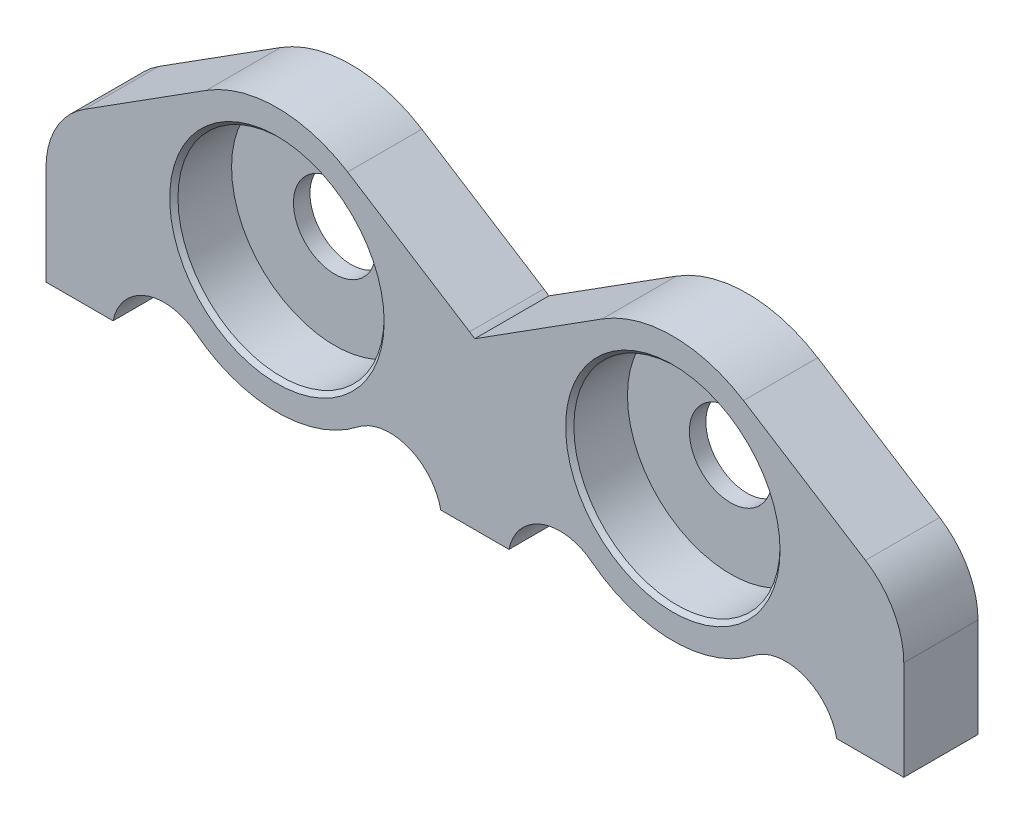
ISO-10303-21;
HEADER;
FILE_DESCRIPTION(('STEP AP214'),'2;1');
FILE_NAME('part.step','',(''),(''),'','','');
FILE_SCHEMA(('AUTOMOTIVE_DESIGN { 1 0 10303 214 1 1 1 1 }'));
ENDSEC;
DATA;
#1=APPLICATION_CONTEXT('core data for automotive mechanical design processes');
#2=APPLICATION_PROTOCOL_DEFINITION('international standard','automotive_design',2000,#1);
#3=PRODUCT_CONTEXT('',#1,'mechanical');
#4=PRODUCT('Part','Part','',(#3));
#5=PRODUCT_RELATED_PRODUCT_CATEGORY('part','',(#4));
#6=PRODUCT_DEFINITION_FORMATION('','',#4);
#7=PRODUCT_DEFINITION_CONTEXT('part definition',#1,'design');
#8=PRODUCT_DEFINITION('design','',#6,#7);
#9=PRODUCT_DEFINITION_SHAPE('','',#8);
#10=(LENGTH_UNIT() NAMED_UNIT(*) SI_UNIT(.MILLI.,.METRE.));
#11=(NAMED_UNIT(*) PLANE_ANGLE_UNIT() SI_UNIT($,.RADIAN.));
#12=(NAMED_UNIT(*) SI_UNIT($,.STERADIAN.) SOLID_ANGLE_UNIT());
#13=UNCERTAINTY_MEASURE_WITH_UNIT(LENGTH_MEASURE(1.E-05),#10,'distance_accuracy_value','');
#14=(GEOMETRIC_REPRESENTATION_CONTEXT(3) GLOBAL_UNCERTAINTY_ASSIGNED_CONTEXT((#13)) GLOBAL_UNIT_ASSIGNED_CONTEXT((#10,
#11,#12)) REPRESENTATION_CONTEXT('',''));
#15=CARTESIAN_POINT('',(0.,0.,0.));
#16=DIRECTION('',(0.,0.,1.));
#17=DIRECTION('',(1.,0.,0.));
#18=AXIS2_PLACEMENT_3D('',#15,#16,#17);
#19=CARTESIAN_POINT('',(8.34596377007962,54.3419699291666,62.151213910356));
#20=DIRECTION('',(0.,0.,1.));
#21=DIRECTION('',(1.,0.,0.));
#22=AXIS2_PLACEMENT_3D('',#19,#20,#21);
#23=CONICAL_SURFACE('',#22,6.,0.785398163397448);
#24=CARTESIAN_POINT('',(8.34596377007962,54.3419699291666,62.651213910356));
#25=DIRECTION('',(0.,0.,-1.));
#26=DIRECTION('',(1.,0.,0.));
#27=AXIS2_PLACEMENT_3D('',#24,#25,#26);
#28=CIRCLE('',#27,6.5);
#29=CARTESIAN_POINT('',(14.8459637700796,54.3419699291666,62.651213910356));
#30=VERTEX_POINT('',#29);
#31=EDGE_CURVE('E319',#30,#30,#28,.T.);
#32=ORIENTED_EDGE('',*,*,#31,.F.);
#33=EDGE_LOOP('',(#32));
#34=FACE_BOUND('',#33,.T.);
#35=CARTESIAN_POINT('',(8.34596377007962,54.3419699291666,62.401213910356));
#36=DIRECTION('',(0.,0.,1.));
#37=DIRECTION('',(1.,0.,0.));
#38=AXIS2_PLACEMENT_3D('',#35,#36,#37);
#39=CIRCLE('',#38,6.25);
#40=CARTESIAN_POINT('',(14.5959637700796,54.3419699291666,62.401213910356));
#41=VERTEX_POINT('',#40);
#42=EDGE_CURVE('E278',#41,#41,#39,.T.);
#43=ORIENTED_EDGE('',*,*,#42,.F.);
#44=EDGE_LOOP('',(#43));
#45=FACE_BOUND('',#44,.T.);
#46=ADVANCED_FACE('F44',(#34,#45),#23,.F.);
#47=CARTESIAN_POINT('',(32.3459637700796,54.3419699291666,62.151213910356));
#48=DIRECTION('',(0.,0.,1.));
#49=DIRECTION('',(1.,0.,0.));
#50=AXIS2_PLACEMENT_3D('',#47,#48,#49);
#51=CONICAL_SURFACE('',#50,6.,0.785398163397448);
#52=CARTESIAN_POINT('',(32.3459637700796,54.3419699291666,62.651213910356));
#53=DIRECTION('',(0.,0.,-1.));
#54=DIRECTION('',(1.,0.,0.));
#55=AXIS2_PLACEMENT_3D('',#52,#53,#54);
#56=CIRCLE('',#55,6.5);
#57=CARTESIAN_POINT('',(38.8459637700796,54.3419699291666,62.651213910356));
#58=VERTEX_POINT('',#57);
#59=EDGE_CURVE('E247',#58,#58,#56,.T.);
#60=ORIENTED_EDGE('',*,*,#59,.F.);
#61=EDGE_LOOP('',(#60));
#62=FACE_BOUND('',#61,.T.);
#63=CARTESIAN_POINT('',(32.3459637700796,54.3419699291666,62.401213910356));
#64=DIRECTION('',(0.,0.,1.));
#65=DIRECTION('',(1.,0.,0.));
#66=AXIS2_PLACEMENT_3D('',#63,#64,#65);
#67=CIRCLE('',#66,6.25);
#68=CARTESIAN_POINT('',(38.5959637700796,54.3419699291666,62.401213910356));
#69=VERTEX_POINT('',#68);
#70=EDGE_CURVE('E231',#69,#69,#67,.T.);
#71=ORIENTED_EDGE('',*,*,#70,.F.);
#72=EDGE_LOOP('',(#71));
#73=FACE_BOUND('',#72,.T.);
#74=ADVANCED_FACE('F403',(#62,#73),#51,.F.);
#75=CARTESIAN_POINT('',(22.3459637700796,54.3419699291666,62.651213910356));
#76=DIRECTION('',(0.,0.,1.));
#77=DIRECTION('',(1.,0.,0.));
#78=AXIS2_PLACEMENT_3D('',#75,#76,#77);
#79=PLANE('',#78);
#80=DIRECTION('',(-0.844399315538351,-0.535714285714282,0.));
#81=VECTOR('',#80,1.);
#82=CARTESIAN_POINT('',(23.2679796118673,58.0567931688773,62.651213910356));
#83=LINE('',#82,#81);
#84=CARTESIAN_POINT('',(28.0602494843653,61.0971644534734,62.651213910356));
#85=VERTEX_POINT('',#84);
#86=CARTESIAN_POINT('',(20.3328860646183,56.1946747206091,62.651213910356));
#87=VERTEX_POINT('',#86);
#88=EDGE_CURVE('E286',#85,#87,#83,.T.);
#89=ORIENTED_EDGE('',*,*,#88,.T.);
#90=CARTESIAN_POINT('',(17.3459637700796,52.1848997635338,62.651213910356));
#91=DIRECTION('',(0.,0.,-1.));
#92=DIRECTION('',(1.,0.,0.));
#93=AXIS2_PLACEMENT_3D('',#90,#91,#92);
#94=CIRCLE('',#93,5.);
#95=CARTESIAN_POINT('',(20.024535198651,56.4068963412255,62.651213910356));
#96=VERTEX_POINT('',#95);
#97=EDGE_CURVE('E344',#96,#87,#94,.T.);
#98=ORIENTED_EDGE('',*,*,#97,.F.);
#99=DIRECTION('',(-0.844399315538349,0.535714285714286,0.));
#100=VECTOR('',#99,1.);
#101=CARTESIAN_POINT('',(22.6138209129367,54.7641695869358,62.651213910356));
#102=LINE('',#101,#100);
#103=CARTESIAN_POINT('',(12.6316780557939,61.0971644534734,62.651213910356));
#104=VERTEX_POINT('',#103);
#105=EDGE_CURVE('E316',#96,#104,#102,.T.);
#106=ORIENTED_EDGE('',*,*,#105,.T.);
#107=CARTESIAN_POINT('',(8.34596377007962,54.3419699291666,62.651213910356));
#108=DIRECTION('',(0.,0.,1.));
#109=DIRECTION('',(1.,0.,0.));
#110=AXIS2_PLACEMENT_3D('',#107,#108,#109);
#111=CIRCLE('',#110,8.);
#112=CARTESIAN_POINT('',(4.06024948436533,61.0971644534734,62.651213910356));
#113=VERTEX_POINT('',#112);
#114=EDGE_CURVE('E310',#104,#113,#111,.T.);
#115=ORIENTED_EDGE('',*,*,#114,.T.);
#116=DIRECTION('',(0.844399315538349,0.535714285714286,0.));
#117=VECTOR('',#116,1.);
#118=CARTESIAN_POINT('',(14.0423923415082,67.430159320011,62.651213910356));
#119=LINE('',#118,#117);
#120=CARTESIAN_POINT('',(-3.33260765849178,56.4068963412255,62.651213910356));
#121=VERTEX_POINT('',#120);
#122=EDGE_CURVE('E343',#121,#113,#119,.T.);
#123=ORIENTED_EDGE('',*,*,#122,.F.);
#124=CARTESIAN_POINT('',(-0.65403622992038,52.1848997635338,62.651213910356));
#125=DIRECTION('',(0.,0.,1.));
#126=DIRECTION('',(1.,0.,0.));
#127=AXIS2_PLACEMENT_3D('',#124,#125,#126);
#128=CIRCLE('',#127,5.);
#129=CARTESIAN_POINT('',(-5.65403622992038,52.1848997635338,62.651213910356));
#130=VERTEX_POINT('',#129);
#131=EDGE_CURVE('E307',#121,#130,#128,.T.);
#132=ORIENTED_EDGE('',*,*,#131,.T.);
#133=DIRECTION('',(0.,1.,0.));
#134=VECTOR('',#133,1.);
#135=CARTESIAN_POINT('',(-5.65403622992038,54.3419699291666,62.651213910356));
#136=LINE('',#135,#134);
#137=CARTESIAN_POINT('',(-5.65403622992038,46.1735391422732,62.651213910356));
#138=VERTEX_POINT('',#137);
#139=EDGE_CURVE('E304',#138,#130,#136,.T.);
#140=ORIENTED_EDGE('',*,*,#139,.F.);
#141=DIRECTION('',(-1.,0.,0.));
#142=VECTOR('',#141,1.);
#143=CARTESIAN_POINT('',(22.3459637700796,46.1735391422732,62.651213910356));
#144=LINE('',#143,#142);
#145=CARTESIAN_POINT('',(-1.58798580855407,46.1735391422732,62.651213910356));
#146=VERTEX_POINT('',#145);
#147=EDGE_CURVE('E218',#146,#138,#144,.T.);
#148=ORIENTED_EDGE('',*,*,#147,.F.);
#149=CARTESIAN_POINT('',(1.50234267065872,45.5312014938457,62.651213910356));
#150=DIRECTION('',(0.,0.,-1.));
#151=DIRECTION('',(1.,0.,0.));
#152=AXIS2_PLACEMENT_3D('',#149,#150,#151);
#153=CIRCLE('',#152,3.15637890057911);
#154=CARTESIAN_POINT('',(3.43854987859506,48.0239568793491,62.651213910356));
#155=VERTEX_POINT('',#154);
#156=EDGE_CURVE('E311',#146,#155,#153,.T.);
#157=ORIENTED_EDGE('',*,*,#156,.T.);
#158=CARTESIAN_POINT('',(8.34596377007962,54.3419699291666,62.651213910356));
#159=DIRECTION('',(0.,0.,1.));
#160=DIRECTION('',(1.,0.,0.));
#161=AXIS2_PLACEMENT_3D('',#158,#159,#160);
#162=CIRCLE('',#161,8.);
#163=CARTESIAN_POINT('',(13.2533776615642,48.0239568793491,62.651213910356));
#164=VERTEX_POINT('',#163);
#165=EDGE_CURVE('E333',#155,#164,#162,.T.);
#166=ORIENTED_EDGE('',*,*,#165,.T.);
#167=CARTESIAN_POINT('',(15.1895848695005,45.5312014938457,62.651213910356));
#168=DIRECTION('',(0.,0.,1.));
#169=DIRECTION('',(1.,0.,0.));
#170=AXIS2_PLACEMENT_3D('',#167,#168,#169);
#171=CIRCLE('',#170,3.15637890057911);
#172=CARTESIAN_POINT('',(18.2799133487133,46.1735391422732,62.651213910356));
#173=VERTEX_POINT('',#172);
#174=EDGE_CURVE('E347',#173,#164,#171,.T.);
#175=ORIENTED_EDGE('',*,*,#174,.F.);
#176=DIRECTION('',(-1.,0.,0.));
#177=VECTOR('',#176,1.);
#178=CARTESIAN_POINT('',(22.3459637700796,46.1735391422732,62.651213910356));
#179=LINE('',#178,#177);
#180=CARTESIAN_POINT('',(22.4120141914459,46.1735391422732,62.651213910356));
#181=VERTEX_POINT('',#180);
#182=EDGE_CURVE('E306',#181,#173,#179,.T.);
#183=ORIENTED_EDGE('',*,*,#182,.F.);
#184=CARTESIAN_POINT('',(25.5023426706587,45.5312014938457,62.651213910356));
#185=DIRECTION('',(0.,0.,-1.));
#186=DIRECTION('',(1.,0.,0.));
#187=AXIS2_PLACEMENT_3D('',#184,#185,#186);
#188=CIRCLE('',#187,3.15637890057911);
#189=CARTESIAN_POINT('',(27.4385498785951,48.0239568793491,62.651213910356));
#190=VERTEX_POINT('',#189);
#191=EDGE_CURVE('E263',#181,#190,#188,.T.);
#192=ORIENTED_EDGE('',*,*,#191,.T.);
#193=CARTESIAN_POINT('',(32.3459637700796,54.3419699291666,62.651213910356));
#194=DIRECTION('',(0.,0.,1.));
#195=DIRECTION('',(1.,0.,0.));
#196=AXIS2_PLACEMENT_3D('',#193,#194,#195);
#197=CIRCLE('',#196,8.);
#198=CARTESIAN_POINT('',(37.2533776615642,48.0239568793491,62.651213910356));
#199=VERTEX_POINT('',#198);
#200=EDGE_CURVE('E260',#190,#199,#197,.T.);
#201=ORIENTED_EDGE('',*,*,#200,.T.);
#202=CARTESIAN_POINT('',(39.1895848695005,45.5312014938457,62.651213910356));
#203=DIRECTION('',(0.,0.,1.));
#204=DIRECTION('',(1.,0.,0.));
#205=AXIS2_PLACEMENT_3D('',#202,#203,#204);
#206=CIRCLE('',#205,3.15637890057911);
#207=CARTESIAN_POINT('',(42.2799133487133,46.1735391422732,62.651213910356));
#208=VERTEX_POINT('',#207);
#209=EDGE_CURVE('E271',#208,#199,#206,.T.);
#210=ORIENTED_EDGE('',*,*,#209,.F.);
#211=DIRECTION('',(-1.,0.,0.));
#212=VECTOR('',#211,1.);
#213=CARTESIAN_POINT('',(46.3459637700796,46.1735391422732,62.651213910356));
#214=LINE('',#213,#212);
#215=CARTESIAN_POINT('',(46.3459637700796,46.1735391422732,62.651213910356));
#216=VERTEX_POINT('',#215);
#217=EDGE_CURVE('E243',#216,#208,#214,.T.);
#218=ORIENTED_EDGE('',*,*,#217,.F.);
#219=DIRECTION('',(0.,1.,0.));
#220=VECTOR('',#219,1.);
#221=CARTESIAN_POINT('',(46.3459637700796,54.3419699291666,62.651213910356));
#222=LINE('',#221,#220);
#223=CARTESIAN_POINT('',(46.3459637700796,52.1848997635338,62.651213910356));
#224=VERTEX_POINT('',#223);
#225=EDGE_CURVE('E240',#216,#224,#222,.T.);
#226=ORIENTED_EDGE('',*,*,#225,.T.);
#227=CARTESIAN_POINT('',(41.3459637700796,52.1848997635338,62.651213910356));
#228=DIRECTION('',(0.,0.,-1.));
#229=DIRECTION('',(1.,0.,0.));
#230=AXIS2_PLACEMENT_3D('',#227,#228,#229);
#231=CIRCLE('',#230,5.);
#232=CARTESIAN_POINT('',(44.024535198651,56.4068963412255,62.651213910356));
#233=VERTEX_POINT('',#232);
#234=EDGE_CURVE('E269',#233,#224,#231,.T.);
#235=ORIENTED_EDGE('',*,*,#234,.F.);
#236=DIRECTION('',(-0.844399315538349,0.535714285714286,0.));
#237=VECTOR('',#236,1.);
#238=CARTESIAN_POINT('',(46.6138209129367,54.7641695869358,62.651213910356));
#239=LINE('',#238,#237);
#240=CARTESIAN_POINT('',(36.6316780557939,61.0971644534734,62.651213910356));
#241=VERTEX_POINT('',#240);
#242=EDGE_CURVE('E237',#233,#241,#239,.T.);
#243=ORIENTED_EDGE('',*,*,#242,.T.);
#244=CARTESIAN_POINT('',(32.3459637700796,54.3419699291666,62.651213910356));
#245=DIRECTION('',(0.,0.,1.));
#246=DIRECTION('',(1.,0.,0.));
#247=AXIS2_PLACEMENT_3D('',#244,#245,#246);
#248=CIRCLE('',#247,8.);
#249=EDGE_CURVE('E241',#241,#85,#248,.T.);
#250=ORIENTED_EDGE('',*,*,#249,.T.);
#251=EDGE_LOOP('',(#89,#98,#106,#115,#123,#132,#140,#148,#157,#166,#175,#183,#192,#201,#210,
#218,#226,#235,#243,#250));
#252=FACE_BOUND('',#251,.T.);
#253=ORIENTED_EDGE('',*,*,#59,.T.);
#254=EDGE_LOOP('',(#253));
#255=FACE_BOUND('',#254,.T.);
#256=ORIENTED_EDGE('',*,*,#31,.T.);
#257=EDGE_LOOP('',(#256));
#258=FACE_BOUND('',#257,.T.);
#259=ADVANCED_FACE('F405',(#252,#255,#258),#79,.T.);
#260=CARTESIAN_POINT('',(-5.65403622992038,37.4718316251289,49.1512139103561));
#261=DIRECTION('',(1.,0.,0.));
#262=DIRECTION('',(0.,1.,0.));
#263=AXIS2_PLACEMENT_3D('',#260,#261,#262);
#264=PLANE('',#263);
#265=DIRECTION('',(0.,1.,0.));
#266=VECTOR('',#265,1.);
#267=CARTESIAN_POINT('',(-5.65403622992038,54.3419699291666,58.151213910356));
#268=LINE('',#267,#266);
#269=CARTESIAN_POINT('',(-5.65403622992038,46.1735391422732,58.151213910356));
#270=VERTEX_POINT('',#269);
#271=CARTESIAN_POINT('',(-5.65403622992038,52.1848997635338,58.151213910356));
#272=VERTEX_POINT('',#271);
#273=EDGE_CURVE('E196',#270,#272,#268,.T.);
#274=ORIENTED_EDGE('',*,*,#273,.F.);
#275=DIRECTION('',(0.,0.,1.));
#276=VECTOR('',#275,1.);
#277=CARTESIAN_POINT('',(-5.65403622992038,46.1735391422732,49.1512139103561));
#278=LINE('',#277,#276);
#279=EDGE_CURVE('E198',#270,#138,#278,.T.);
#280=ORIENTED_EDGE('',*,*,#279,.T.);
#281=ORIENTED_EDGE('',*,*,#139,.T.);
#282=DIRECTION('',(0.,0.,1.));
#283=VECTOR('',#282,1.);
#284=CARTESIAN_POINT('',(-5.65403622992038,52.1848997635338,58.151213910356));
#285=LINE('',#284,#283);
#286=EDGE_CURVE('E201',#272,#130,#285,.T.);
#287=ORIENTED_EDGE('',*,*,#286,.F.);
#288=EDGE_LOOP('',(#274,#280,#281,#287));
#289=FACE_BOUND('',#288,.T.);
#290=ADVANCED_FACE('F197',(#289),#264,.F.);
#291=CARTESIAN_POINT('',(8.34596377007962,52.4686638907544,58.151213910356));
#292=DIRECTION('',(0.,0.,1.));
#293=DIRECTION('',(1.,0.,0.));
#294=AXIS2_PLACEMENT_3D('',#291,#292,#293);
#295=PLANE('',#294);
#296=CARTESIAN_POINT('',(25.5023426706587,45.5312014938457,58.151213910356));
#297=DIRECTION('',(0.,0.,-1.));
#298=DIRECTION('',(1.,0.,0.));
#299=AXIS2_PLACEMENT_3D('',#296,#297,#298);
#300=CIRCLE('',#299,3.15637890057911);
#301=CARTESIAN_POINT('',(22.4120141914459,46.1735391422732,58.151213910356));
#302=VERTEX_POINT('',#301);
#303=CARTESIAN_POINT('',(27.4385467766676,48.0239592887208,58.151213910356));
#304=VERTEX_POINT('',#303);
#305=EDGE_CURVE('E251',#302,#304,#300,.T.);
#306=ORIENTED_EDGE('',*,*,#305,.F.);
#307=DIRECTION('',(-1.,0.,0.));
#308=VECTOR('',#307,1.);
#309=CARTESIAN_POINT('',(8.34596377007962,46.1735391422732,58.151213910356));
#310=LINE('',#309,#308);
#311=CARTESIAN_POINT('',(18.2799133487133,46.1735391422732,58.151213910356));
#312=VERTEX_POINT('',#311);
#313=EDGE_CURVE('E215',#302,#312,#310,.T.);
#314=ORIENTED_EDGE('',*,*,#313,.T.);
#315=CARTESIAN_POINT('',(15.1895848695005,45.5312014938457,58.151213910356));
#316=DIRECTION('',(0.,0.,1.));
#317=DIRECTION('',(1.,0.,0.));
#318=AXIS2_PLACEMENT_3D('',#315,#316,#317);
#319=CIRCLE('',#318,3.15637890057911);
#320=CARTESIAN_POINT('',(13.2533807638557,48.0239592890036,58.151213910356));
#321=VERTEX_POINT('',#320);
#322=EDGE_CURVE('E327',#312,#321,#319,.T.);
#323=ORIENTED_EDGE('',*,*,#322,.T.);
#324=CARTESIAN_POINT('',(8.34596377007962,54.3419699291666,58.151213910356));
#325=DIRECTION('',(0.,0.,1.));
#326=DIRECTION('',(1.,0.,0.));
#327=AXIS2_PLACEMENT_3D('',#324,#325,#326);
#328=CIRCLE('',#327,8.);
#329=CARTESIAN_POINT('',(3.43854677666762,48.0239592887208,58.151213910356));
#330=VERTEX_POINT('',#329);
#331=EDGE_CURVE('E323',#330,#321,#328,.T.);
#332=ORIENTED_EDGE('',*,*,#331,.F.);
#333=CARTESIAN_POINT('',(1.50234267065872,45.5312014938457,58.151213910356));
#334=DIRECTION('',(0.,0.,-1.));
#335=DIRECTION('',(1.,0.,0.));
#336=AXIS2_PLACEMENT_3D('',#333,#334,#335);
#337=CIRCLE('',#336,3.15637890057911);
#338=CARTESIAN_POINT('',(-1.58798580855407,46.1735391422732,58.151213910356));
#339=VERTEX_POINT('',#338);
#340=EDGE_CURVE('E211',#339,#330,#337,.T.);
#341=ORIENTED_EDGE('',*,*,#340,.F.);
#342=EDGE_CURVE('E68',#339,#270,#310,.T.);
#343=ORIENTED_EDGE('',*,*,#342,.T.);
#344=ORIENTED_EDGE('',*,*,#273,.T.);
#345=CARTESIAN_POINT('',(-0.65403622992038,52.1848997635338,58.151213910356));
#346=DIRECTION('',(0.,0.,1.));
#347=DIRECTION('',(1.,0.,0.));
#348=AXIS2_PLACEMENT_3D('',#345,#346,#347);
#349=CIRCLE('',#348,5.);
#350=CARTESIAN_POINT('',(-3.33260765849178,56.4068963412255,58.151213910356));
#351=VERTEX_POINT('',#350);
#352=EDGE_CURVE('E329',#351,#272,#349,.T.);
#353=ORIENTED_EDGE('',*,*,#352,.F.);
#354=DIRECTION('',(0.844399315538349,0.535714285714286,0.));
#355=VECTOR('',#354,1.);
#356=CARTESIAN_POINT('',(3.21284680402829,60.5595447358168,58.151213910356));
#357=LINE('',#356,#355);
#358=CARTESIAN_POINT('',(4.06024948436533,61.0971644534734,58.151213910356));
#359=VERTEX_POINT('',#358);
#360=EDGE_CURVE('E204',#351,#359,#357,.T.);
#361=ORIENTED_EDGE('',*,*,#360,.T.);
#362=CARTESIAN_POINT('',(8.34596377007962,54.3419699291666,58.151213910356));
#363=DIRECTION('',(0.,0.,1.));
#364=DIRECTION('',(1.,0.,0.));
#365=AXIS2_PLACEMENT_3D('',#362,#363,#364);
#366=CIRCLE('',#365,8.);
#367=CARTESIAN_POINT('',(12.6316780557939,61.0971644534734,58.151213910356));
#368=VERTEX_POINT('',#367);
#369=EDGE_CURVE('E312',#368,#359,#366,.T.);
#370=ORIENTED_EDGE('',*,*,#369,.F.);
#371=DIRECTION('',(-0.844399315538349,0.535714285714286,0.));
#372=VECTOR('',#371,1.);
#373=CARTESIAN_POINT('',(13.4790807361309,60.5595447358168,58.151213910356));
#374=LINE('',#373,#372);
#375=CARTESIAN_POINT('',(20.024535198651,56.4068963412255,58.151213910356));
#376=VERTEX_POINT('',#375);
#377=EDGE_CURVE('E332',#376,#368,#374,.T.);
#378=ORIENTED_EDGE('',*,*,#377,.F.);
#379=CARTESIAN_POINT('',(17.3459637700796,52.1848997635338,58.151213910356));
#380=DIRECTION('',(0.,0.,-1.));
#381=DIRECTION('',(1.,0.,0.));
#382=AXIS2_PLACEMENT_3D('',#379,#380,#381);
#383=CIRCLE('',#382,5.);
#384=CARTESIAN_POINT('',(20.3328860646183,56.1946747206091,58.151213910356));
#385=VERTEX_POINT('',#384);
#386=EDGE_CURVE('E324',#376,#385,#383,.T.);
#387=ORIENTED_EDGE('',*,*,#386,.T.);
#388=DIRECTION('',(0.844399315538351,0.535714285714282,0.));
#389=VECTOR('',#388,1.);
#390=CARTESIAN_POINT('',(23.2679796118673,58.0567931688773,58.151213910356));
#391=LINE('',#390,#389);
#392=CARTESIAN_POINT('',(28.0602494843653,61.0971644534734,58.151213910356));
#393=VERTEX_POINT('',#392);
#394=EDGE_CURVE('E301',#385,#393,#391,.T.);
#395=ORIENTED_EDGE('',*,*,#394,.T.);
#396=CARTESIAN_POINT('',(32.3459637700796,54.3419699291666,58.151213910356));
#397=DIRECTION('',(0.,0.,1.));
#398=DIRECTION('',(1.,0.,0.));
#399=AXIS2_PLACEMENT_3D('',#396,#397,#398);
#400=CIRCLE('',#399,8.);
#401=CARTESIAN_POINT('',(36.6316780557939,61.0971644534734,58.151213910356));
#402=VERTEX_POINT('',#401);
#403=EDGE_CURVE('E232',#402,#393,#400,.T.);
#404=ORIENTED_EDGE('',*,*,#403,.F.);
#405=DIRECTION('',(-0.844399315538349,0.535714285714286,0.));
#406=VECTOR('',#405,1.);
#407=CARTESIAN_POINT('',(37.4790807361309,60.5595447358168,58.151213910356));
#408=LINE('',#407,#406);
#409=CARTESIAN_POINT('',(44.024535198651,56.4068963412255,58.151213910356));
#410=VERTEX_POINT('',#409);
#411=EDGE_CURVE('E259',#410,#402,#408,.T.);
#412=ORIENTED_EDGE('',*,*,#411,.F.);
#413=CARTESIAN_POINT('',(41.3459637700796,52.1848997635338,58.151213910356));
#414=DIRECTION('',(0.,0.,-1.));
#415=DIRECTION('',(1.,0.,0.));
#416=AXIS2_PLACEMENT_3D('',#413,#414,#415);
#417=CIRCLE('',#416,5.);
#418=CARTESIAN_POINT('',(46.3459637700796,52.1848997635338,58.151213910356));
#419=VERTEX_POINT('',#418);
#420=EDGE_CURVE('E253',#410,#419,#417,.T.);
#421=ORIENTED_EDGE('',*,*,#420,.T.);
#422=DIRECTION('',(0.,1.,0.));
#423=VECTOR('',#422,1.);
#424=CARTESIAN_POINT('',(46.3459637700796,54.3419699291666,58.151213910356));
#425=LINE('',#424,#423);
#426=CARTESIAN_POINT('',(46.3459637700796,46.1735391422732,58.151213910356));
#427=VERTEX_POINT('',#426);
#428=EDGE_CURVE('E60',#427,#419,#425,.T.);
#429=ORIENTED_EDGE('',*,*,#428,.F.);
#430=CARTESIAN_POINT('',(42.2799133487133,46.1735391422732,58.151213910356));
#431=VERTEX_POINT('',#430);
#432=EDGE_CURVE('E214',#427,#431,#310,.T.);
#433=ORIENTED_EDGE('',*,*,#432,.T.);
#434=CARTESIAN_POINT('',(39.1895848695005,45.5312014938457,58.151213910356));
#435=DIRECTION('',(0.,0.,1.));
#436=DIRECTION('',(1.,0.,0.));
#437=AXIS2_PLACEMENT_3D('',#434,#435,#436);
#438=CIRCLE('',#437,3.15637890057911);
#439=CARTESIAN_POINT('',(37.2533807638557,48.0239592890036,58.151213910356));
#440=VERTEX_POINT('',#439);
#441=EDGE_CURVE('E256',#431,#440,#438,.T.);
#442=ORIENTED_EDGE('',*,*,#441,.T.);
#443=CARTESIAN_POINT('',(32.3459637700796,54.3419699291666,58.151213910356));
#444=DIRECTION('',(0.,0.,1.));
#445=DIRECTION('',(1.,0.,0.));
#446=AXIS2_PLACEMENT_3D('',#443,#444,#445);
#447=CIRCLE('',#446,8.);
#448=EDGE_CURVE('E252',#304,#440,#447,.T.);
#449=ORIENTED_EDGE('',*,*,#448,.F.);
#450=EDGE_LOOP('',(#306,#314,#323,#332,#341,#343,#344,#353,#361,#370,#378,#387,#395,#404,#412,
#421,#429,#433,#442,#449));
#451=FACE_BOUND('',#450,.T.);
#452=CARTESIAN_POINT('',(32.3459637700796,54.3419699291666,58.151213910356));
#453=DIRECTION('',(0.,0.,1.));
#454=DIRECTION('',(1.,0.,0.));
#455=AXIS2_PLACEMENT_3D('',#452,#453,#454);
#456=CIRCLE('',#455,2.5);
#457=CARTESIAN_POINT('',(34.8459637700796,54.3419699291666,58.151213910356));
#458=VERTEX_POINT('',#457);
#459=EDGE_CURVE('E255',#458,#458,#456,.T.);
#460=ORIENTED_EDGE('',*,*,#459,.T.);
#461=EDGE_LOOP('',(#460));
#462=FACE_BOUND('',#461,.T.);
#463=CARTESIAN_POINT('',(8.34596377007962,54.3419699291666,58.151213910356));
#464=DIRECTION('',(0.,0.,1.));
#465=DIRECTION('',(1.,0.,0.));
#466=AXIS2_PLACEMENT_3D('',#463,#464,#465);
#467=CIRCLE('',#466,2.5);
#468=CARTESIAN_POINT('',(10.8459637700796,54.3419699291666,58.151213910356));
#469=VERTEX_POINT('',#468);
#470=EDGE_CURVE('E203',#469,#469,#467,.T.);
#471=ORIENTED_EDGE('',*,*,#470,.T.);
#472=EDGE_LOOP('',(#471));
#473=FACE_BOUND('',#472,.T.);
#474=ADVANCED_FACE('F208',(#451,#462,#473),#295,.F.);
#475=CARTESIAN_POINT('',(15.1895848695005,45.5312014938457,58.151213910356));
#476=DIRECTION('',(0.,0.,1.));
#477=DIRECTION('',(1.,0.,0.));
#478=AXIS2_PLACEMENT_3D('',#475,#476,#477);
#479=CYLINDRICAL_SURFACE('',#478,3.15637890057911);
#480=ORIENTED_EDGE('',*,*,#322,.F.);
#481=DIRECTION('',(0.,0.,1.));
#482=VECTOR('',#481,1.);
#483=CARTESIAN_POINT('',(18.2799133487133,46.1735391422732,58.151213910356));
#484=LINE('',#483,#482);
#485=EDGE_CURVE('E490',#312,#173,#484,.T.);
#486=ORIENTED_EDGE('',*,*,#485,.T.);
#487=ORIENTED_EDGE('',*,*,#174,.T.);
#488=DIRECTION('',(0.,0.,1.));
#489=VECTOR('',#488,1.);
#490=CARTESIAN_POINT('',(13.2533776615642,48.0239568793491,60.1512139103561));
#491=LINE('',#490,#489);
#492=EDGE_CURVE('E303',#321,#164,#491,.T.);
#493=ORIENTED_EDGE('',*,*,#492,.F.);
#494=EDGE_LOOP('',(#480,#486,#487,#493));
#495=FACE_BOUND('',#494,.T.);
#496=ADVANCED_FACE('F458',(#495),#479,.F.);
#497=CARTESIAN_POINT('',(17.3459637700796,52.1848997635338,58.151213910356));
#498=DIRECTION('',(0.,0.,1.));
#499=DIRECTION('',(1.,0.,0.));
#500=AXIS2_PLACEMENT_3D('',#497,#498,#499);
#501=CYLINDRICAL_SURFACE('',#500,5.);
#502=DIRECTION('',(0.,0.,1.));
#503=VECTOR('',#502,1.);
#504=CARTESIAN_POINT('',(20.3328860646183,56.1946747206091,58.151213910356));
#505=LINE('',#504,#503);
#506=EDGE_CURVE('E367',#385,#87,#505,.T.);
#507=ORIENTED_EDGE('',*,*,#506,.F.);
#508=ORIENTED_EDGE('',*,*,#386,.F.);
#509=DIRECTION('',(0.,0.,1.));
#510=VECTOR('',#509,1.);
#511=CARTESIAN_POINT('',(20.024535198651,56.4068963412255,58.151213910356));
#512=LINE('',#511,#510);
#513=EDGE_CURVE('E340',#376,#96,#512,.T.);
#514=ORIENTED_EDGE('',*,*,#513,.T.);
#515=ORIENTED_EDGE('',*,*,#97,.T.);
#516=EDGE_LOOP('',(#507,#508,#514,#515));
#517=FACE_BOUND('',#516,.T.);
#518=ADVANCED_FACE('F46',(#517),#501,.T.);
#519=CARTESIAN_POINT('',(16.4620351986511,58.6670617721276,58.151213910356));
#520=DIRECTION('',(0.535714285714286,0.844399315538349,0.));
#521=DIRECTION('',(0.,0.,-1.));
#522=AXIS2_PLACEMENT_3D('',#519,#520,#521);
#523=PLANE('',#522);
#524=ORIENTED_EDGE('',*,*,#105,.F.);
#525=ORIENTED_EDGE('',*,*,#513,.F.);
#526=ORIENTED_EDGE('',*,*,#377,.T.);
#527=DIRECTION('',(0.,0.,1.));
#528=VECTOR('',#527,1.);
#529=CARTESIAN_POINT('',(12.6316780557939,61.0971644534734,58.151213910356));
#530=LINE('',#529,#528);
#531=EDGE_CURVE('E313',#368,#104,#530,.T.);
#532=ORIENTED_EDGE('',*,*,#531,.T.);
#533=EDGE_LOOP('',(#524,#525,#526,#532));
#534=FACE_BOUND('',#533,.T.);
#535=ADVANCED_FACE('F446',(#534),#523,.T.);
#536=CARTESIAN_POINT('',(8.34596377007962,54.3419699291666,58.151213910356));
#537=DIRECTION('',(0.,0.,1.));
#538=DIRECTION('',(1.,0.,0.));
#539=AXIS2_PLACEMENT_3D('',#536,#537,#538);
#540=CYLINDRICAL_SURFACE('',#539,8.);
#541=ORIENTED_EDGE('',*,*,#114,.F.);
#542=ORIENTED_EDGE('',*,*,#531,.F.);
#543=ORIENTED_EDGE('',*,*,#369,.T.);
#544=DIRECTION('',(0.,0.,1.));
#545=VECTOR('',#544,1.);
#546=CARTESIAN_POINT('',(4.06024948436533,61.0971644534734,58.151213910356));
#547=LINE('',#546,#545);
#548=EDGE_CURVE('E314',#359,#113,#547,.T.);
#549=ORIENTED_EDGE('',*,*,#548,.T.);
#550=EDGE_LOOP('',(#541,#542,#543,#549));
#551=FACE_BOUND('',#550,.T.);
#552=ADVANCED_FACE('F449',(#551),#540,.T.);
#553=CARTESIAN_POINT('',(0.229892341508189,58.6670617721276,58.151213910356));
#554=DIRECTION('',(0.535714285714286,-0.844399315538349,0.));
#555=DIRECTION('',(0.,0.,-1.));
#556=AXIS2_PLACEMENT_3D('',#553,#554,#555);
#557=PLANE('',#556);
#558=ORIENTED_EDGE('',*,*,#122,.T.);
#559=ORIENTED_EDGE('',*,*,#548,.F.);
#560=ORIENTED_EDGE('',*,*,#360,.F.);
#561=DIRECTION('',(0.,0.,1.));
#562=VECTOR('',#561,1.);
#563=CARTESIAN_POINT('',(-3.33260765849178,56.4068963412255,58.151213910356));
#564=LINE('',#563,#562);
#565=EDGE_CURVE('E337',#351,#121,#564,.T.);
#566=ORIENTED_EDGE('',*,*,#565,.T.);
#567=EDGE_LOOP('',(#558,#559,#560,#566));
#568=FACE_BOUND('',#567,.T.);
#569=ADVANCED_FACE('F444',(#568),#557,.F.);
#570=CARTESIAN_POINT('',(-0.65403622992038,52.1848997635338,58.151213910356));
#571=DIRECTION('',(0.,0.,1.));
#572=DIRECTION('',(1.,0.,0.));
#573=AXIS2_PLACEMENT_3D('',#570,#571,#572);
#574=CYLINDRICAL_SURFACE('',#573,5.);
#575=ORIENTED_EDGE('',*,*,#131,.F.);
#576=ORIENTED_EDGE('',*,*,#565,.F.);
#577=ORIENTED_EDGE('',*,*,#352,.T.);
#578=ORIENTED_EDGE('',*,*,#286,.T.);
#579=EDGE_LOOP('',(#575,#576,#577,#578));
#580=FACE_BOUND('',#579,.T.);
#581=ADVANCED_FACE('F440',(#580),#574,.T.);
#582=CARTESIAN_POINT('',(1.50234267065872,45.5312014938457,58.151213910356));
#583=DIRECTION('',(0.,0.,1.));
#584=DIRECTION('',(1.,0.,0.));
#585=AXIS2_PLACEMENT_3D('',#582,#583,#584);
#586=CYLINDRICAL_SURFACE('',#585,3.15637890057911);
#587=ORIENTED_EDGE('',*,*,#156,.F.);
#588=DIRECTION('',(0.,0.,1.));
#589=VECTOR('',#588,1.);
#590=CARTESIAN_POINT('',(-1.58798580855407,46.1735391422732,58.151213910356));
#591=LINE('',#590,#589);
#592=EDGE_CURVE('E212',#146,#339,#591,.F.);
#593=ORIENTED_EDGE('',*,*,#592,.T.);
#594=ORIENTED_EDGE('',*,*,#340,.T.);
#595=DIRECTION('',(0.,0.,1.));
#596=VECTOR('',#595,1.);
#597=CARTESIAN_POINT('',(3.43854987859506,48.0239568793491,60.1512139103561));
#598=LINE('',#597,#596);
#599=EDGE_CURVE('E320',#330,#155,#598,.T.);
#600=ORIENTED_EDGE('',*,*,#599,.T.);
#601=EDGE_LOOP('',(#587,#593,#594,#600));
#602=FACE_BOUND('',#601,.T.);
#603=ADVANCED_FACE('F443',(#602),#586,.F.);
#604=CARTESIAN_POINT('',(8.34596377007962,54.3419699291666,58.151213910356));
#605=DIRECTION('',(0.,0.,1.));
#606=DIRECTION('',(1.,0.,0.));
#607=AXIS2_PLACEMENT_3D('',#604,#605,#606);
#608=CYLINDRICAL_SURFACE('',#607,8.);
#609=ORIENTED_EDGE('',*,*,#165,.F.);
#610=ORIENTED_EDGE('',*,*,#599,.F.);
#611=ORIENTED_EDGE('',*,*,#331,.T.);
#612=ORIENTED_EDGE('',*,*,#492,.T.);
#613=EDGE_LOOP('',(#609,#610,#611,#612));
#614=FACE_BOUND('',#613,.T.);
#615=ADVANCED_FACE('F453',(#614),#608,.T.);
#616=CARTESIAN_POINT('',(8.34596377007962,54.3419699291666,49.451213910356));
#617=DIRECTION('',(0.,0.,1.));
#618=DIRECTION('',(1.,0.,0.));
#619=AXIS2_PLACEMENT_3D('',#616,#617,#618);
#620=CYLINDRICAL_SURFACE('',#619,2.5);
#621=ORIENTED_EDGE('',*,*,#470,.F.);
#622=EDGE_LOOP('',(#621));
#623=FACE_BOUND('',#622,.T.);
#624=CARTESIAN_POINT('',(8.34596377007962,54.3419699291666,59.1512139103561));
#625=DIRECTION('',(0.,0.,1.));
#626=DIRECTION('',(1.,0.,0.));
#627=AXIS2_PLACEMENT_3D('',#624,#625,#626);
#628=CIRCLE('',#627,2.5);
#629=CARTESIAN_POINT('',(10.8459637700796,54.3419699291666,59.1512139103561));
#630=VERTEX_POINT('',#629);
#631=EDGE_CURVE('E223',#630,#630,#628,.T.);
#632=ORIENTED_EDGE('',*,*,#631,.T.);
#633=EDGE_LOOP('',(#632));
#634=FACE_BOUND('',#633,.T.);
#635=ADVANCED_FACE('F438',(#623,#634),#620,.F.);
#636=CARTESIAN_POINT('',(23.2679796118673,58.0567931688773,48.8077901879058));
#637=DIRECTION('',(-0.535714285714282,0.844399315538351,0.));
#638=DIRECTION('',(-0.844399315538351,-0.535714285714282,0.));
#639=AXIS2_PLACEMENT_3D('',#636,#637,#638);
#640=PLANE('',#639);
#641=DIRECTION('',(0.,0.,1.));
#642=VECTOR('',#641,1.);
#643=CARTESIAN_POINT('',(28.0602494843653,61.0971644534734,58.151213910356));
#644=LINE('',#643,#642);
#645=EDGE_CURVE('E236',#393,#85,#644,.T.);
#646=ORIENTED_EDGE('',*,*,#645,.F.);
#647=ORIENTED_EDGE('',*,*,#394,.F.);
#648=ORIENTED_EDGE('',*,*,#506,.T.);
#649=ORIENTED_EDGE('',*,*,#88,.F.);
#650=EDGE_LOOP('',(#646,#647,#648,#649));
#651=FACE_BOUND('',#650,.T.);
#652=ADVANCED_FACE('F434',(#651),#640,.T.);
#653=CARTESIAN_POINT('',(46.3459637700796,37.4718316251289,49.1512139103561));
#654=DIRECTION('',(1.,0.,0.));
#655=DIRECTION('',(0.,1.,0.));
#656=AXIS2_PLACEMENT_3D('',#653,#654,#655);
#657=PLANE('',#656);
#658=DIRECTION('',(0.,0.,1.));
#659=VECTOR('',#658,1.);
#660=CARTESIAN_POINT('',(46.3459637700796,46.1735391422732,62.651213910356));
#661=LINE('',#660,#659);
#662=EDGE_CURVE('E497',#427,#216,#661,.T.);
#663=ORIENTED_EDGE('',*,*,#662,.F.);
#664=ORIENTED_EDGE('',*,*,#428,.T.);
#665=DIRECTION('',(0.,0.,1.));
#666=VECTOR('',#665,1.);
#667=CARTESIAN_POINT('',(46.3459637700796,52.1848997635338,58.151213910356));
#668=LINE('',#667,#666);
#669=EDGE_CURVE('E244',#419,#224,#668,.T.);
#670=ORIENTED_EDGE('',*,*,#669,.T.);
#671=ORIENTED_EDGE('',*,*,#225,.F.);
#672=EDGE_LOOP('',(#663,#664,#670,#671));
#673=FACE_BOUND('',#672,.T.);
#674=ADVANCED_FACE('F437',(#673),#657,.T.);
#675=CARTESIAN_POINT('',(39.1895848695005,45.5312014938457,58.151213910356));
#676=DIRECTION('',(0.,0.,1.));
#677=DIRECTION('',(1.,0.,0.));
#678=AXIS2_PLACEMENT_3D('',#675,#676,#677);
#679=CYLINDRICAL_SURFACE('',#678,3.15637890057911);
#680=ORIENTED_EDGE('',*,*,#441,.F.);
#681=DIRECTION('',(0.,0.,1.));
#682=VECTOR('',#681,1.);
#683=CARTESIAN_POINT('',(42.2799133487133,46.1735391422732,58.151213910356));
#684=LINE('',#683,#682);
#685=EDGE_CURVE('E493',#431,#208,#684,.T.);
#686=ORIENTED_EDGE('',*,*,#685,.T.);
#687=ORIENTED_EDGE('',*,*,#209,.T.);
#688=DIRECTION('',(0.,0.,1.));
#689=VECTOR('',#688,1.);
#690=CARTESIAN_POINT('',(37.2533776615642,48.0239568793491,60.1512139103561));
#691=LINE('',#690,#689);
#692=EDGE_CURVE('E275',#440,#199,#691,.T.);
#693=ORIENTED_EDGE('',*,*,#692,.F.);
#694=EDGE_LOOP('',(#680,#686,#687,#693));
#695=FACE_BOUND('',#694,.T.);
#696=ADVANCED_FACE('F418',(#695),#679,.F.);
#697=CARTESIAN_POINT('',(41.3459637700796,52.1848997635338,58.151213910356));
#698=DIRECTION('',(0.,0.,1.));
#699=DIRECTION('',(1.,0.,0.));
#700=AXIS2_PLACEMENT_3D('',#697,#698,#699);
#701=CYLINDRICAL_SURFACE('',#700,5.);
#702=ORIENTED_EDGE('',*,*,#234,.T.);
#703=ORIENTED_EDGE('',*,*,#669,.F.);
#704=ORIENTED_EDGE('',*,*,#420,.F.);
#705=DIRECTION('',(0.,0.,1.));
#706=VECTOR('',#705,1.);
#707=CARTESIAN_POINT('',(44.024535198651,56.4068963412255,58.151213910356));
#708=LINE('',#707,#706);
#709=EDGE_CURVE('E266',#410,#233,#708,.T.);
#710=ORIENTED_EDGE('',*,*,#709,.T.);
#711=EDGE_LOOP('',(#702,#703,#704,#710));
#712=FACE_BOUND('',#711,.T.);
#713=ADVANCED_FACE('F430',(#712),#701,.T.);
#714=CARTESIAN_POINT('',(40.462035198651,58.6670617721276,58.151213910356));
#715=DIRECTION('',(0.535714285714286,0.844399315538349,0.));
#716=DIRECTION('',(0.,0.,-1.));
#717=AXIS2_PLACEMENT_3D('',#714,#715,#716);
#718=PLANE('',#717);
#719=ORIENTED_EDGE('',*,*,#242,.F.);
#720=ORIENTED_EDGE('',*,*,#709,.F.);
#721=ORIENTED_EDGE('',*,*,#411,.T.);
#722=DIRECTION('',(0.,0.,1.));
#723=VECTOR('',#722,1.);
#724=CARTESIAN_POINT('',(36.6316780557939,61.0971644534734,58.151213910356));
#725=LINE('',#724,#723);
#726=EDGE_CURVE('E235',#402,#241,#725,.T.);
#727=ORIENTED_EDGE('',*,*,#726,.T.);
#728=EDGE_LOOP('',(#719,#720,#721,#727));
#729=FACE_BOUND('',#728,.T.);
#730=ADVANCED_FACE('F428',(#729),#718,.T.);
#731=CARTESIAN_POINT('',(32.3459637700796,54.3419699291666,58.151213910356));
#732=DIRECTION('',(0.,0.,1.));
#733=DIRECTION('',(1.,0.,0.));
#734=AXIS2_PLACEMENT_3D('',#731,#732,#733);
#735=CYLINDRICAL_SURFACE('',#734,8.);
#736=ORIENTED_EDGE('',*,*,#249,.F.);
#737=ORIENTED_EDGE('',*,*,#726,.F.);
#738=ORIENTED_EDGE('',*,*,#403,.T.);
#739=ORIENTED_EDGE('',*,*,#645,.T.);
#740=EDGE_LOOP('',(#736,#737,#738,#739));
#741=FACE_BOUND('',#740,.T.);
#742=ADVANCED_FACE('F425',(#741),#735,.T.);
#743=CARTESIAN_POINT('',(25.5023426706587,45.5312014938457,58.151213910356));
#744=DIRECTION('',(0.,0.,1.));
#745=DIRECTION('',(1.,0.,0.));
#746=AXIS2_PLACEMENT_3D('',#743,#744,#745);
#747=CYLINDRICAL_SURFACE('',#746,3.15637890057911);
#748=ORIENTED_EDGE('',*,*,#191,.F.);
#749=DIRECTION('',(0.,0.,1.));
#750=VECTOR('',#749,1.);
#751=CARTESIAN_POINT('',(22.4120141914459,46.1735391422732,58.151213910356));
#752=LINE('',#751,#750);
#753=EDGE_CURVE('E11',#181,#302,#752,.F.);
#754=ORIENTED_EDGE('',*,*,#753,.T.);
#755=ORIENTED_EDGE('',*,*,#305,.T.);
#756=DIRECTION('',(0.,0.,1.));
#757=VECTOR('',#756,1.);
#758=CARTESIAN_POINT('',(27.4385498785951,48.0239568793491,60.1512139103561));
#759=LINE('',#758,#757);
#760=EDGE_CURVE('E248',#304,#190,#759,.T.);
#761=ORIENTED_EDGE('',*,*,#760,.T.);
#762=EDGE_LOOP('',(#748,#754,#755,#761));
#763=FACE_BOUND('',#762,.T.);
#764=ADVANCED_FACE('F423',(#763),#747,.F.);
#765=CARTESIAN_POINT('',(32.3459637700796,54.3419699291666,58.151213910356));
#766=DIRECTION('',(0.,0.,1.));
#767=DIRECTION('',(1.,0.,0.));
#768=AXIS2_PLACEMENT_3D('',#765,#766,#767);
#769=CYLINDRICAL_SURFACE('',#768,8.);
#770=ORIENTED_EDGE('',*,*,#200,.F.);
#771=ORIENTED_EDGE('',*,*,#760,.F.);
#772=ORIENTED_EDGE('',*,*,#448,.T.);
#773=ORIENTED_EDGE('',*,*,#692,.T.);
#774=EDGE_LOOP('',(#770,#771,#772,#773));
#775=FACE_BOUND('',#774,.T.);
#776=ADVANCED_FACE('F420',(#775),#769,.T.);
#777=CARTESIAN_POINT('',(32.3459637700796,54.3419699291666,49.451213910356));
#778=DIRECTION('',(0.,0.,1.));
#779=DIRECTION('',(1.,0.,0.));
#780=AXIS2_PLACEMENT_3D('',#777,#778,#779);
#781=CYLINDRICAL_SURFACE('',#780,2.5);
#782=ORIENTED_EDGE('',*,*,#459,.F.);
#783=EDGE_LOOP('',(#782));
#784=FACE_BOUND('',#783,.T.);
#785=CARTESIAN_POINT('',(32.3459637700796,54.3419699291666,59.1512139103561));
#786=DIRECTION('',(0.,0.,1.));
#787=DIRECTION('',(1.,0.,0.));
#788=AXIS2_PLACEMENT_3D('',#785,#786,#787);
#789=CIRCLE('',#788,2.5);
#790=CARTESIAN_POINT('',(34.8459637700796,54.3419699291666,59.1512139103561));
#791=VERTEX_POINT('',#790);
#792=EDGE_CURVE('E220',#791,#791,#789,.T.);
#793=ORIENTED_EDGE('',*,*,#792,.T.);
#794=EDGE_LOOP('',(#793));
#795=FACE_BOUND('',#794,.T.);
#796=ADVANCED_FACE('F399',(#784,#795),#781,.F.);
#797=CARTESIAN_POINT('',(32.3459637700796,54.3419699291666,68.9512139103561));
#798=DIRECTION('',(0.,0.,-1.));
#799=DIRECTION('',(-1.,0.,0.));
#800=AXIS2_PLACEMENT_3D('',#797,#798,#799);
#801=CYLINDRICAL_SURFACE('',#800,6.25);
#802=CARTESIAN_POINT('',(32.3459637700796,54.3419699291666,59.1512139103561));
#803=DIRECTION('',(0.,0.,1.));
#804=DIRECTION('',(1.,0.,0.));
#805=AXIS2_PLACEMENT_3D('',#802,#803,#804);
#806=CIRCLE('',#805,6.25);
#807=CARTESIAN_POINT('',(38.5959637700796,54.3419699291666,59.1512139103561));
#808=VERTEX_POINT('',#807);
#809=EDGE_CURVE('E53',#808,#808,#806,.T.);
#810=ORIENTED_EDGE('',*,*,#809,.F.);
#811=EDGE_LOOP('',(#810));
#812=FACE_BOUND('',#811,.T.);
#813=ORIENTED_EDGE('',*,*,#70,.T.);
#814=EDGE_LOOP('',(#813));
#815=FACE_BOUND('',#814,.T.);
#816=ADVANCED_FACE('F395',(#812,#815),#801,.F.);
#817=CARTESIAN_POINT('',(8.34596377007962,54.3419699291666,68.9512139103561));
#818=DIRECTION('',(0.,0.,-1.));
#819=DIRECTION('',(-1.,0.,0.));
#820=AXIS2_PLACEMENT_3D('',#817,#818,#819);
#821=CYLINDRICAL_SURFACE('',#820,6.25);
#822=CARTESIAN_POINT('',(8.34596377007962,54.3419699291666,59.1512139103561));
#823=DIRECTION('',(0.,0.,1.));
#824=DIRECTION('',(1.,0.,0.));
#825=AXIS2_PLACEMENT_3D('',#822,#823,#824);
#826=CIRCLE('',#825,6.25);
#827=CARTESIAN_POINT('',(14.5959637700796,54.3419699291666,59.1512139103561));
#828=VERTEX_POINT('',#827);
#829=EDGE_CURVE('E382',#828,#828,#826,.T.);
#830=ORIENTED_EDGE('',*,*,#829,.F.);
#831=EDGE_LOOP('',(#830));
#832=FACE_BOUND('',#831,.T.);
#833=ORIENTED_EDGE('',*,*,#42,.T.);
#834=EDGE_LOOP('',(#833));
#835=FACE_BOUND('',#834,.T.);
#836=ADVANCED_FACE('F398',(#832,#835),#821,.F.);
#837=CARTESIAN_POINT('',(8.34596377007962,54.3419699291666,59.1512139103561));
#838=DIRECTION('',(0.,0.,1.));
#839=DIRECTION('',(1.,0.,0.));
#840=AXIS2_PLACEMENT_3D('',#837,#838,#839);
#841=PLANE('',#840);
#842=ORIENTED_EDGE('',*,*,#829,.T.);
#843=EDGE_LOOP('',(#842));
#844=FACE_BOUND('',#843,.T.);
#845=ORIENTED_EDGE('',*,*,#631,.F.);
#846=EDGE_LOOP('',(#845));
#847=FACE_BOUND('',#846,.T.);
#848=ADVANCED_FACE('F520',(#844,#847),#841,.T.);
#849=CARTESIAN_POINT('',(32.3459637700796,54.3419699291666,59.1512139103561));
#850=DIRECTION('',(0.,0.,1.));
#851=DIRECTION('',(1.,0.,0.));
#852=AXIS2_PLACEMENT_3D('',#849,#850,#851);
#853=PLANE('',#852);
#854=ORIENTED_EDGE('',*,*,#809,.T.);
#855=EDGE_LOOP('',(#854));
#856=FACE_BOUND('',#855,.T.);
#857=ORIENTED_EDGE('',*,*,#792,.F.);
#858=EDGE_LOOP('',(#857));
#859=FACE_BOUND('',#858,.T.);
#860=ADVANCED_FACE('F392',(#856,#859),#853,.T.);
#861=CARTESIAN_POINT('',(-5.65406122992038,46.1735391422732,62.651213910356));
#862=DIRECTION('',(0.,1.,0.));
#863=DIRECTION('',(0.,0.,1.));
#864=AXIS2_PLACEMENT_3D('',#861,#862,#863);
#865=PLANE('',#864);
#866=ORIENTED_EDGE('',*,*,#313,.F.);
#867=ORIENTED_EDGE('',*,*,#753,.F.);
#868=ORIENTED_EDGE('',*,*,#182,.T.);
#869=ORIENTED_EDGE('',*,*,#485,.F.);
#870=EDGE_LOOP('',(#866,#867,#868,#869));
#871=FACE_BOUND('',#870,.T.);
#872=ADVANCED_FACE('F512',(#871),#865,.F.);
#873=ORIENTED_EDGE('',*,*,#432,.F.);
#874=ORIENTED_EDGE('',*,*,#662,.T.);
#875=ORIENTED_EDGE('',*,*,#217,.T.);
#876=ORIENTED_EDGE('',*,*,#685,.F.);
#877=EDGE_LOOP('',(#873,#874,#875,#876));
#878=FACE_BOUND('',#877,.T.);
#879=ADVANCED_FACE('F514',(#878),#865,.F.);
#880=ORIENTED_EDGE('',*,*,#279,.F.);
#881=ORIENTED_EDGE('',*,*,#342,.F.);
#882=ORIENTED_EDGE('',*,*,#592,.F.);
#883=ORIENTED_EDGE('',*,*,#147,.T.);
#884=EDGE_LOOP('',(#880,#881,#882,#883));
#885=FACE_BOUND('',#884,.T.);
#886=ADVANCED_FACE('F216',(#885),#865,.F.);
#887=CLOSED_SHELL('',(#46,#74,#259,#290,#474,#496,#518,#535,#552,#569,#581,#603,#615,#635,#652,
#674,#696,#713,#730,#742,#764,#776,#796,#816,#836,#848,#860,#872,#879,#886));
#888=MANIFOLD_SOLID_BREP('B2',#887);
#889=ADVANCED_BREP_SHAPE_REPRESENTATION('',(#18,#888),#14);
#890=SHAPE_DEFINITION_REPRESENTATION(#9,#889);
ENDSEC;
END-ISO-10303-21;
